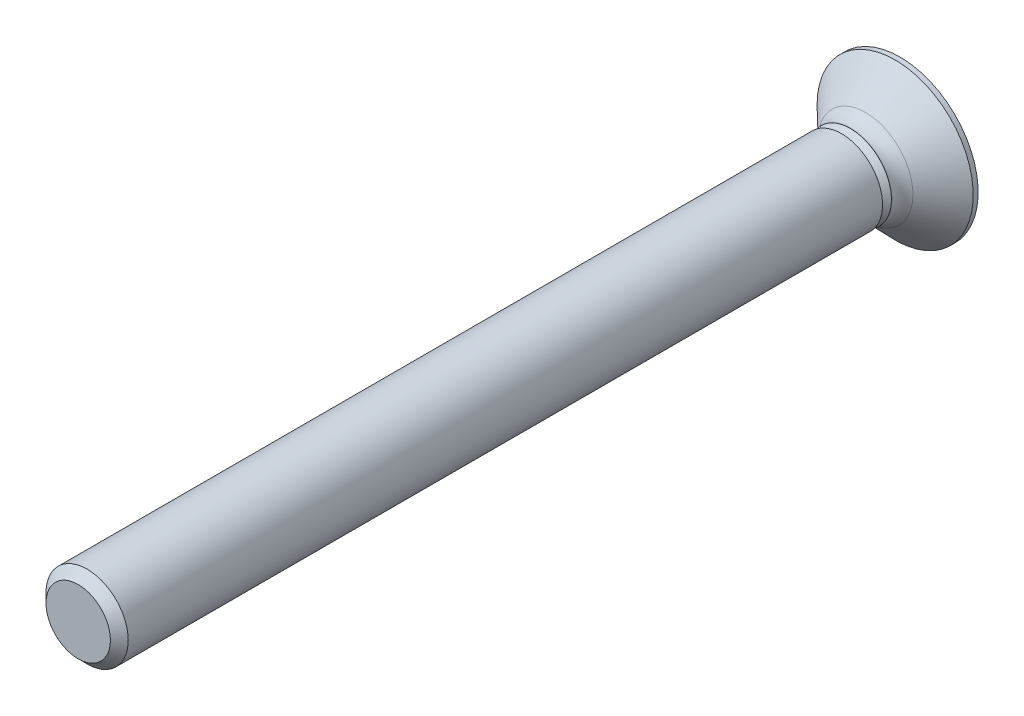
ISO-10303-21;
HEADER;
FILE_DESCRIPTION(('STEP AP214'),'2;1');
FILE_NAME('part.step','',(''),(''),'','','');
FILE_SCHEMA(('AUTOMOTIVE_DESIGN { 1 0 10303 214 1 1 1 1 }'));
ENDSEC;
DATA;
#1=APPLICATION_CONTEXT('core data for automotive mechanical design processes');
#2=APPLICATION_PROTOCOL_DEFINITION('international standard','automotive_design',2000,#1);
#3=PRODUCT_CONTEXT('',#1,'mechanical');
#4=PRODUCT('Part','Part','',(#3));
#5=PRODUCT_RELATED_PRODUCT_CATEGORY('part','',(#4));
#6=PRODUCT_DEFINITION_FORMATION('','',#4);
#7=PRODUCT_DEFINITION_CONTEXT('part definition',#1,'design');
#8=PRODUCT_DEFINITION('design','',#6,#7);
#9=PRODUCT_DEFINITION_SHAPE('','',#8);
#10=(LENGTH_UNIT() NAMED_UNIT(*) SI_UNIT(.MILLI.,.METRE.));
#11=(NAMED_UNIT(*) PLANE_ANGLE_UNIT() SI_UNIT($,.RADIAN.));
#12=(NAMED_UNIT(*) SI_UNIT($,.STERADIAN.) SOLID_ANGLE_UNIT());
#13=UNCERTAINTY_MEASURE_WITH_UNIT(LENGTH_MEASURE(1.E-05),#10,'distance_accuracy_value','');
#14=(GEOMETRIC_REPRESENTATION_CONTEXT(3) GLOBAL_UNCERTAINTY_ASSIGNED_CONTEXT((#13)) GLOBAL_UNIT_ASSIGNED_CONTEXT((#10,
#11,#12)) REPRESENTATION_CONTEXT('',''));
#15=CARTESIAN_POINT('',(0.,0.,0.));
#16=DIRECTION('',(0.,0.,1.));
#17=DIRECTION('',(1.,0.,0.));
#18=AXIS2_PLACEMENT_3D('',#15,#16,#17);
#19=CARTESIAN_POINT('',(0.,0.,42.2262328618571));
#20=DIRECTION('',(0.,0.,-1.));
#21=DIRECTION('',(-1.,0.,0.));
#22=AXIS2_PLACEMENT_3D('',#19,#20,#21);
#23=CYLINDRICAL_SURFACE('',#22,3.125);
#24=CARTESIAN_POINT('',(0.,0.,41.5496703618571));
#25=DIRECTION('',(0.,0.,1.));
#26=DIRECTION('',(1.,0.,0.));
#27=AXIS2_PLACEMENT_3D('',#24,#25,#26);
#28=CIRCLE('',#27,3.125);
#29=CARTESIAN_POINT('',(3.125,0.,41.5496703618571));
#30=VERTEX_POINT('',#29);
#31=EDGE_CURVE('E243',#30,#30,#28,.F.);
#32=ORIENTED_EDGE('',*,*,#31,.T.);
#33=EDGE_LOOP('',(#32));
#34=FACE_BOUND('',#33,.T.);
#35=CARTESIAN_POINT('',(0.,0.,-15.8159546381429));
#36=DIRECTION('',(0.,0.,-1.));
#37=DIRECTION('',(-1.,0.,0.));
#38=AXIS2_PLACEMENT_3D('',#35,#36,#37);
#39=CIRCLE('',#38,3.125);
#40=CARTESIAN_POINT('',(-3.125,0.,-15.8159546381429));
#41=VERTEX_POINT('',#40);
#42=EDGE_CURVE('E240',#41,#41,#39,.T.);
#43=ORIENTED_EDGE('',*,*,#42,.F.);
#44=EDGE_LOOP('',(#43));
#45=FACE_BOUND('',#44,.T.);
#46=ADVANCED_FACE('F35',(#34,#45),#23,.T.);
#47=CARTESIAN_POINT('',(3.125,0.,42.2262328618571));
#48=DIRECTION('',(0.,0.,1.));
#49=DIRECTION('',(1.,0.,0.));
#50=AXIS2_PLACEMENT_3D('',#47,#48,#49);
#51=PLANE('',#50);
#52=CARTESIAN_POINT('',(0.,0.,42.2262328618571));
#53=DIRECTION('',(0.,0.,1.));
#54=DIRECTION('',(1.,0.,0.));
#55=AXIS2_PLACEMENT_3D('',#52,#53,#54);
#56=CIRCLE('',#55,2.44843749999999);
#57=CARTESIAN_POINT('',(2.4484375,0.,42.2262328618571));
#58=VERTEX_POINT('',#57);
#59=EDGE_CURVE('E246',#58,#58,#56,.T.);
#60=ORIENTED_EDGE('',*,*,#59,.T.);
#61=EDGE_LOOP('',(#60));
#62=FACE_BOUND('',#61,.T.);
#63=ADVANCED_FACE('F264',(#62),#51,.T.);
#64=CARTESIAN_POINT('',(0.,0.,-15.8159546381429));
#65=DIRECTION('',(0.,0.,-1.));
#66=DIRECTION('',(-1.,0.,0.));
#67=AXIS2_PLACEMENT_3D('',#64,#65,#66);
#68=PLANE('',#67);
#69=CARTESIAN_POINT('',(0.,0.,-15.8159546381429));
#70=DIRECTION('',(0.,0.,-1.));
#71=DIRECTION('',(-1.,0.,0.));
#72=AXIS2_PLACEMENT_3D('',#69,#70,#71);
#73=CIRCLE('',#72,2.4484375);
#74=CARTESIAN_POINT('',(-2.4484375,0.,-15.8159546381429));
#75=VERTEX_POINT('',#74);
#76=EDGE_CURVE('E234',#75,#75,#73,.T.);
#77=ORIENTED_EDGE('',*,*,#76,.F.);
#78=EDGE_LOOP('',(#77));
#79=FACE_BOUND('',#78,.T.);
#80=ORIENTED_EDGE('',*,*,#42,.T.);
#81=EDGE_LOOP('',(#80));
#82=FACE_BOUND('',#81,.T.);
#83=ADVANCED_FACE('F270',(#79,#82),#68,.T.);
#84=CARTESIAN_POINT('',(0.,0.,-15.8159546381429));
#85=DIRECTION('',(0.,0.,-1.));
#86=DIRECTION('',(-1.,0.,0.));
#87=AXIS2_PLACEMENT_3D('',#84,#85,#86);
#88=CONICAL_SURFACE('',#87,2.4484375,0.785398163397452);
#89=CARTESIAN_POINT('',(0.,0.,-16.4925171381429));
#90=DIRECTION('',(0.,0.,-1.));
#91=DIRECTION('',(-1.,0.,0.));
#92=AXIS2_PLACEMENT_3D('',#89,#90,#91);
#93=CIRCLE('',#92,3.12500000000001);
#94=CARTESIAN_POINT('',(-3.12500000000001,0.,-16.4925171381429));
#95=VERTEX_POINT('',#94);
#96=EDGE_CURVE('E237',#95,#95,#93,.T.);
#97=ORIENTED_EDGE('',*,*,#96,.F.);
#98=EDGE_LOOP('',(#97));
#99=FACE_BOUND('',#98,.T.);
#100=ORIENTED_EDGE('',*,*,#76,.T.);
#101=EDGE_LOOP('',(#100));
#102=FACE_BOUND('',#101,.T.);
#103=ADVANCED_FACE('F277',(#99,#102),#88,.T.);
#104=CARTESIAN_POINT('',(0.,0.,-17.1874382337001));
#105=DIRECTION('',(0.,0.,1.));
#106=DIRECTION('',(1.,0.,0.));
#107=AXIS2_PLACEMENT_3D('',#104,#105,#106);
#108=CYLINDRICAL_SURFACE('',#107,3.125);
#109=CARTESIAN_POINT('',(0.,0.,-16.5234032073764));
#110=DIRECTION('',(0.,0.,-1.));
#111=DIRECTION('',(-1.,0.,0.));
#112=AXIS2_PLACEMENT_3D('',#109,#110,#111);
#113=CIRCLE('',#112,3.125);
#114=CARTESIAN_POINT('',(-3.125,0.,-16.5234032073764));
#115=VERTEX_POINT('',#114);
#116=EDGE_CURVE('E11',#115,#115,#113,.F.);
#117=ORIENTED_EDGE('',*,*,#116,.T.);
#118=EDGE_LOOP('',(#117));
#119=FACE_BOUND('',#118,.T.);
#120=ORIENTED_EDGE('',*,*,#96,.T.);
#121=EDGE_LOOP('',(#120));
#122=FACE_BOUND('',#121,.T.);
#123=ADVANCED_FACE('F281',(#119,#122),#108,.T.);
#124=CARTESIAN_POINT('',(0.,0.,-17.1874382337001));
#125=DIRECTION('',(0.,0.,-1.));
#126=DIRECTION('',(-1.,0.,0.));
#127=AXIS2_PLACEMENT_3D('',#124,#125,#126);
#128=CONICAL_SURFACE('',#127,3.125,0.803711508514973);
#129=CARTESIAN_POINT('',(0.,0.,-17.648304733871));
#130=DIRECTION('',(0.,0.,-1.));
#131=DIRECTION('',(-1.,0.,0.));
#132=AXIS2_PLACEMENT_3D('',#129,#130,#131);
#133=CIRCLE('',#132,3.60306336944473);
#134=CARTESIAN_POINT('',(-3.60306336944473,0.,-17.648304733871));
#135=VERTEX_POINT('',#134);
#136=EDGE_CURVE('E43',#135,#135,#133,.T.);
#137=ORIENTED_EDGE('',*,*,#136,.T.);
#138=EDGE_LOOP('',(#137));
#139=FACE_BOUND('',#138,.T.);
#140=CARTESIAN_POINT('',(0.,0.,-19.8987671381429));
#141=DIRECTION('',(0.,0.,-1.));
#142=DIRECTION('',(-1.,0.,0.));
#143=AXIS2_PLACEMENT_3D('',#140,#141,#142);
#144=CIRCLE('',#143,5.93750000000002);
#145=CARTESIAN_POINT('',(-5.93750000000002,0.,-19.8987671381429));
#146=VERTEX_POINT('',#145);
#147=EDGE_CURVE('E231',#146,#146,#144,.T.);
#148=ORIENTED_EDGE('',*,*,#147,.F.);
#149=EDGE_LOOP('',(#148));
#150=FACE_BOUND('',#149,.T.);
#151=ADVANCED_FACE('F251',(#139,#150),#128,.T.);
#152=CARTESIAN_POINT('',(0.,0.,-20.2737671381429));
#153=DIRECTION('',(0.,0.,1.));
#154=DIRECTION('',(1.,0.,0.));
#155=AXIS2_PLACEMENT_3D('',#152,#153,#154);
#156=CYLINDRICAL_SURFACE('',#155,5.9375);
#157=CARTESIAN_POINT('',(0.,0.,-20.2737671381429));
#158=DIRECTION('',(0.,0.,-1.));
#159=DIRECTION('',(-1.,0.,0.));
#160=AXIS2_PLACEMENT_3D('',#157,#158,#159);
#161=CIRCLE('',#160,5.9375);
#162=CARTESIAN_POINT('',(-5.9375,0.,-20.2737671381429));
#163=VERTEX_POINT('',#162);
#164=EDGE_CURVE('E179',#163,#163,#161,.T.);
#165=ORIENTED_EDGE('',*,*,#164,.F.);
#166=EDGE_LOOP('',(#165));
#167=FACE_BOUND('',#166,.T.);
#168=ORIENTED_EDGE('',*,*,#147,.T.);
#169=EDGE_LOOP('',(#168));
#170=FACE_BOUND('',#169,.T.);
#171=ADVANCED_FACE('F288',(#167,#170),#156,.T.);
#172=CARTESIAN_POINT('',(0.,0.,-20.2737671381429));
#173=DIRECTION('',(0.,0.,-1.));
#174=DIRECTION('',(-1.,0.,0.));
#175=AXIS2_PLACEMENT_3D('',#172,#173,#174);
#176=PLANE('',#175);
#177=DIRECTION('',(0.,-1.,0.));
#178=VECTOR('',#177,1.);
#179=CARTESIAN_POINT('',(2.96875,0.494791666666667,-20.2737671381429));
#180=LINE('',#179,#178);
#181=CARTESIAN_POINT('',(2.96875,0.494791666666667,-20.2737671381429));
#182=VERTEX_POINT('',#181);
#183=CARTESIAN_POINT('',(2.96875,-0.494791666666667,-20.2737671381429));
#184=VERTEX_POINT('',#183);
#185=EDGE_CURVE('E50',#182,#184,#180,.T.);
#186=ORIENTED_EDGE('',*,*,#185,.F.);
#187=DIRECTION('',(0.90630778703665,-0.422618261740699,0.));
#188=VECTOR('',#187,1.);
#189=CARTESIAN_POINT('',(1.28154723625925,1.28154723625925,-20.2737671381429));
#190=LINE('',#189,#188);
#191=CARTESIAN_POINT('',(1.28154723625925,1.28154723625925,-20.2737671381429));
#192=VERTEX_POINT('',#191);
#193=EDGE_CURVE('E175',#192,#182,#190,.T.);
#194=ORIENTED_EDGE('',*,*,#193,.F.);
#195=DIRECTION('',(0.422618261740699,-0.90630778703665,0.));
#196=VECTOR('',#195,1.);
#197=CARTESIAN_POINT('',(0.494791666666666,2.96875,-20.2737671381429));
#198=LINE('',#197,#196);
#199=CARTESIAN_POINT('',(0.494791666666666,2.96875,-20.2737671381429));
#200=VERTEX_POINT('',#199);
#201=EDGE_CURVE('E173',#200,#192,#198,.T.);
#202=ORIENTED_EDGE('',*,*,#201,.F.);
#203=DIRECTION('',(1.,0.,0.));
#204=VECTOR('',#203,1.);
#205=CARTESIAN_POINT('',(-0.494791666666668,2.96875,-20.2737671381429));
#206=LINE('',#205,#204);
#207=CARTESIAN_POINT('',(-0.494791666666668,2.96875,-20.2737671381429));
#208=VERTEX_POINT('',#207);
#209=EDGE_CURVE('E170',#208,#200,#206,.T.);
#210=ORIENTED_EDGE('',*,*,#209,.F.);
#211=DIRECTION('',(0.422618261740698,0.90630778703665,0.));
#212=VECTOR('',#211,1.);
#213=CARTESIAN_POINT('',(-1.28154723625925,1.28154723625925,-20.2737671381429));
#214=LINE('',#213,#212);
#215=CARTESIAN_POINT('',(-1.28154723625925,1.28154723625925,-20.2737671381429));
#216=VERTEX_POINT('',#215);
#217=EDGE_CURVE('E167',#216,#208,#214,.T.);
#218=ORIENTED_EDGE('',*,*,#217,.F.);
#219=DIRECTION('',(0.90630778703665,0.422618261740699,0.));
#220=VECTOR('',#219,1.);
#221=CARTESIAN_POINT('',(-2.96875,0.494791666666667,-20.2737671381429));
#222=LINE('',#221,#220);
#223=CARTESIAN_POINT('',(-2.96875,0.494791666666667,-20.2737671381429));
#224=VERTEX_POINT('',#223);
#225=EDGE_CURVE('E164',#224,#216,#222,.T.);
#226=ORIENTED_EDGE('',*,*,#225,.F.);
#227=DIRECTION('',(0.,1.,0.));
#228=VECTOR('',#227,1.);
#229=CARTESIAN_POINT('',(-2.96875,-0.494791666666666,-20.2737671381429));
#230=LINE('',#229,#228);
#231=CARTESIAN_POINT('',(-2.96875,-0.494791666666666,-20.2737671381429));
#232=VERTEX_POINT('',#231);
#233=EDGE_CURVE('E161',#232,#224,#230,.T.);
#234=ORIENTED_EDGE('',*,*,#233,.F.);
#235=DIRECTION('',(-0.90630778703665,0.422618261740699,0.));
#236=VECTOR('',#235,1.);
#237=CARTESIAN_POINT('',(-1.28154723625926,-1.28154723625925,-20.2737671381429));
#238=LINE('',#237,#236);
#239=CARTESIAN_POINT('',(-1.28154723625926,-1.28154723625925,-20.2737671381429));
#240=VERTEX_POINT('',#239);
#241=EDGE_CURVE('E158',#240,#232,#238,.T.);
#242=ORIENTED_EDGE('',*,*,#241,.F.);
#243=DIRECTION('',(-0.422618261740699,0.90630778703665,0.));
#244=VECTOR('',#243,1.);
#245=CARTESIAN_POINT('',(-0.494791666666668,-2.96875,-20.2737671381429));
#246=LINE('',#245,#244);
#247=CARTESIAN_POINT('',(-0.494791666666668,-2.96875,-20.2737671381429));
#248=VERTEX_POINT('',#247);
#249=EDGE_CURVE('E152',#248,#240,#246,.T.);
#250=ORIENTED_EDGE('',*,*,#249,.F.);
#251=DIRECTION('',(-1.,0.,0.));
#252=VECTOR('',#251,1.);
#253=CARTESIAN_POINT('',(0.494791666666666,-2.96875,-20.2737671381429));
#254=LINE('',#253,#252);
#255=CARTESIAN_POINT('',(0.494791666666666,-2.96875,-20.2737671381429));
#256=VERTEX_POINT('',#255);
#257=EDGE_CURVE('E150',#256,#248,#254,.T.);
#258=ORIENTED_EDGE('',*,*,#257,.F.);
#259=DIRECTION('',(-0.422618261740699,-0.90630778703665,0.));
#260=VECTOR('',#259,1.);
#261=CARTESIAN_POINT('',(1.28154723625925,-1.28154723625926,-20.2737671381429));
#262=LINE('',#261,#260);
#263=CARTESIAN_POINT('',(1.28154723625925,-1.28154723625926,-20.2737671381429));
#264=VERTEX_POINT('',#263);
#265=EDGE_CURVE('E133',#264,#256,#262,.T.);
#266=ORIENTED_EDGE('',*,*,#265,.F.);
#267=DIRECTION('',(-0.90630778703665,-0.4226182617407,0.));
#268=VECTOR('',#267,1.);
#269=CARTESIAN_POINT('',(2.96875,-0.494791666666667,-20.2737671381429));
#270=LINE('',#269,#268);
#271=EDGE_CURVE('E142',#184,#264,#270,.T.);
#272=ORIENTED_EDGE('',*,*,#271,.F.);
#273=EDGE_LOOP('',(#186,#194,#202,#210,#218,#226,#234,#242,#250,#258,#266,#272));
#274=FACE_BOUND('',#273,.T.);
#275=ORIENTED_EDGE('',*,*,#164,.T.);
#276=EDGE_LOOP('',(#275));
#277=FACE_BOUND('',#276,.T.);
#278=ADVANCED_FACE('F146',(#274,#277),#176,.T.);
#279=CARTESIAN_POINT('',(2.96875,0.494791666666667,-20.2737671381429));
#280=DIRECTION('',(0.965925826289069,0.,0.258819045102518));
#281=DIRECTION('',(0.258819045102518,0.,-0.965925826289069));
#282=AXIS2_PLACEMENT_3D('',#279,#280,#281);
#283=PLANE('',#282);
#284=ORIENTED_EDGE('',*,*,#185,.T.);
#285=DIRECTION('',(0.255370893567971,-0.16268920176799,-0.953057149569946));
#286=VECTOR('',#285,1.);
#287=CARTESIAN_POINT('',(2.92763668490845,-0.468599596298635,-20.1203301573536));
#288=LINE('',#287,#286);
#289=CARTESIAN_POINT('',(2.21514289628748,-0.0146909925581505,-17.4612671381429));
#290=VERTEX_POINT('',#289);
#291=EDGE_CURVE('E93',#290,#184,#288,.T.);
#292=ORIENTED_EDGE('',*,*,#291,.F.);
#293=DIRECTION('',(0.,-1.,0.));
#294=VECTOR('',#293,1.);
#295=CARTESIAN_POINT('',(2.21514289628748,0.,-17.4612671381429));
#296=LINE('',#295,#294);
#297=CARTESIAN_POINT('',(2.21514289628748,0.0146909925581504,-17.4612671381429));
#298=VERTEX_POINT('',#297);
#299=EDGE_CURVE('E177',#298,#290,#296,.T.);
#300=ORIENTED_EDGE('',*,*,#299,.F.);
#301=DIRECTION('',(0.255370893567971,0.16268920176799,-0.953057149569946));
#302=VECTOR('',#301,1.);
#303=CARTESIAN_POINT('',(2.89140687934748,0.4455186646209,-19.9851186822517));
#304=LINE('',#303,#302);
#305=EDGE_CURVE('E58',#298,#182,#304,.T.);
#306=ORIENTED_EDGE('',*,*,#305,.T.);
#307=EDGE_LOOP('',(#284,#292,#300,#306));
#308=FACE_BOUND('',#307,.T.);
#309=ADVANCED_FACE('F294',(#308),#283,.F.);
#310=CARTESIAN_POINT('',(1.28154723625925,1.28154723625925,-20.2737671381429));
#311=DIRECTION('',(0.408217893676735,0.875426098065594,0.258819045102518));
#312=DIRECTION('',(-0.90630778703665,0.422618261740699,0.));
#313=AXIS2_PLACEMENT_3D('',#310,#311,#312);
#314=PLANE('',#313);
#315=ORIENTED_EDGE('',*,*,#193,.T.);
#316=ORIENTED_EDGE('',*,*,#305,.F.);
#317=DIRECTION('',(0.90630778703665,-0.422618261740699,0.));
#318=VECTOR('',#317,1.);
#319=CARTESIAN_POINT('',(0.401265221040901,0.860516043482013,-17.4612671381429));
#320=LINE('',#319,#318);
#321=CARTESIAN_POINT('',(0.714467446976875,0.714467446976876,-17.4612671381429));
#322=VERTEX_POINT('',#321);
#323=EDGE_CURVE('E180',#322,#298,#320,.T.);
#324=ORIENTED_EDGE('',*,*,#323,.F.);
#325=DIRECTION('',(0.193899607686985,0.193899607686985,-0.961668281829897));
#326=VECTOR('',#325,1.);
#327=CARTESIAN_POINT('',(1.28154723625925,1.28154723625925,-20.2737671381429));
#328=LINE('',#327,#326);
#329=EDGE_CURVE('E98',#322,#192,#328,.T.);
#330=ORIENTED_EDGE('',*,*,#329,.T.);
#331=EDGE_LOOP('',(#315,#316,#324,#330));
#332=FACE_BOUND('',#331,.T.);
#333=ADVANCED_FACE('F295',(#332),#314,.F.);
#334=CARTESIAN_POINT('',(0.494791666666666,2.96875,-20.2737671381429));
#335=DIRECTION('',(0.875426098065594,0.408217893676735,0.258819045102518));
#336=DIRECTION('',(-0.422618261740699,0.90630778703665,0.));
#337=AXIS2_PLACEMENT_3D('',#334,#335,#336);
#338=PLANE('',#337);
#339=ORIENTED_EDGE('',*,*,#201,.T.);
#340=ORIENTED_EDGE('',*,*,#329,.F.);
#341=DIRECTION('',(0.422618261740699,-0.90630778703665,0.));
#342=VECTOR('',#341,1.);
#343=CARTESIAN_POINT('',(0.860516043482012,0.401265221040902,-17.4612671381429));
#344=LINE('',#343,#342);
#345=CARTESIAN_POINT('',(0.0146909925581491,2.21514289628748,-17.4612671381429));
#346=VERTEX_POINT('',#345);
#347=EDGE_CURVE('E203',#346,#322,#344,.T.);
#348=ORIENTED_EDGE('',*,*,#347,.F.);
#349=DIRECTION('',(0.16268920176799,0.255370893567971,-0.953057149569946));
#350=VECTOR('',#349,1.);
#351=CARTESIAN_POINT('',(0.468599596298634,2.92763668490845,-20.1203301573536));
#352=LINE('',#351,#350);
#353=EDGE_CURVE('E195',#346,#200,#352,.T.);
#354=ORIENTED_EDGE('',*,*,#353,.T.);
#355=EDGE_LOOP('',(#339,#340,#348,#354));
#356=FACE_BOUND('',#355,.T.);
#357=ADVANCED_FACE('F298',(#356),#338,.F.);
#358=CARTESIAN_POINT('',(-0.494791666666668,2.96875,-20.2737671381429));
#359=DIRECTION('',(0.,0.965925826289069,0.258819045102518));
#360=DIRECTION('',(0.,-0.258819045102518,0.965925826289069));
#361=AXIS2_PLACEMENT_3D('',#358,#359,#360);
#362=PLANE('',#361);
#363=ORIENTED_EDGE('',*,*,#209,.T.);
#364=ORIENTED_EDGE('',*,*,#353,.F.);
#365=DIRECTION('',(1.,0.,0.));
#366=VECTOR('',#365,1.);
#367=CARTESIAN_POINT('',(0.,2.21514289628748,-17.4612671381429));
#368=LINE('',#367,#366);
#369=CARTESIAN_POINT('',(-0.0146909925581508,2.21514289628748,-17.4612671381429));
#370=VERTEX_POINT('',#369);
#371=EDGE_CURVE('E206',#370,#346,#368,.T.);
#372=ORIENTED_EDGE('',*,*,#371,.F.);
#373=DIRECTION('',(-0.16268920176799,0.255370893567971,-0.953057149569946));
#374=VECTOR('',#373,1.);
#375=CARTESIAN_POINT('',(-0.445518664620901,2.89140687934748,-19.9851186822517));
#376=LINE('',#375,#374);
#377=EDGE_CURVE('E193',#370,#208,#376,.T.);
#378=ORIENTED_EDGE('',*,*,#377,.T.);
#379=EDGE_LOOP('',(#363,#364,#372,#378));
#380=FACE_BOUND('',#379,.T.);
#381=ADVANCED_FACE('F301',(#380),#362,.F.);
#382=CARTESIAN_POINT('',(-1.28154723625925,1.28154723625925,-20.2737671381429));
#383=DIRECTION('',(-0.875426098065594,0.408217893676734,0.258819045102518));
#384=DIRECTION('',(-0.422618261740698,-0.90630778703665,0.));
#385=AXIS2_PLACEMENT_3D('',#382,#383,#384);
#386=PLANE('',#385);
#387=ORIENTED_EDGE('',*,*,#217,.T.);
#388=ORIENTED_EDGE('',*,*,#377,.F.);
#389=DIRECTION('',(0.422618261740698,0.90630778703665,0.));
#390=VECTOR('',#389,1.);
#391=CARTESIAN_POINT('',(-0.860516043482012,0.4012652210409,-17.4612671381429));
#392=LINE('',#391,#390);
#393=CARTESIAN_POINT('',(-0.714467446976875,0.714467446976876,-17.4612671381429));
#394=VERTEX_POINT('',#393);
#395=EDGE_CURVE('E209',#394,#370,#392,.T.);
#396=ORIENTED_EDGE('',*,*,#395,.F.);
#397=DIRECTION('',(-0.193899607686985,0.193899607686985,-0.961668281829897));
#398=VECTOR('',#397,1.);
#399=CARTESIAN_POINT('',(-1.28154723625925,1.28154723625925,-20.2737671381429));
#400=LINE('',#399,#398);
#401=EDGE_CURVE('E191',#394,#216,#400,.T.);
#402=ORIENTED_EDGE('',*,*,#401,.T.);
#403=EDGE_LOOP('',(#387,#388,#396,#402));
#404=FACE_BOUND('',#403,.T.);
#405=ADVANCED_FACE('F305',(#404),#386,.F.);
#406=CARTESIAN_POINT('',(-2.96875,0.494791666666667,-20.2737671381429));
#407=DIRECTION('',(-0.408217893676735,0.875426098065594,0.258819045102518));
#408=DIRECTION('',(-0.90630778703665,-0.422618261740699,0.));
#409=AXIS2_PLACEMENT_3D('',#406,#407,#408);
#410=PLANE('',#409);
#411=ORIENTED_EDGE('',*,*,#225,.T.);
#412=ORIENTED_EDGE('',*,*,#401,.F.);
#413=DIRECTION('',(0.90630778703665,0.422618261740699,0.));
#414=VECTOR('',#413,1.);
#415=CARTESIAN_POINT('',(-0.401265221040902,0.860516043482012,-17.4612671381429));
#416=LINE('',#415,#414);
#417=CARTESIAN_POINT('',(-2.21514289628748,0.0146909925581501,-17.4612671381429));
#418=VERTEX_POINT('',#417);
#419=EDGE_CURVE('E212',#418,#394,#416,.T.);
#420=ORIENTED_EDGE('',*,*,#419,.F.);
#421=DIRECTION('',(-0.255370893567972,0.16268920176799,-0.953057149569946));
#422=VECTOR('',#421,1.);
#423=CARTESIAN_POINT('',(-2.92763668490846,0.468599596298635,-20.1203301573536));
#424=LINE('',#423,#422);
#425=EDGE_CURVE('E189',#418,#224,#424,.T.);
#426=ORIENTED_EDGE('',*,*,#425,.T.);
#427=EDGE_LOOP('',(#411,#412,#420,#426));
#428=FACE_BOUND('',#427,.T.);
#429=ADVANCED_FACE('F309',(#428),#410,.F.);
#430=CARTESIAN_POINT('',(-2.96875,-0.494791666666666,-20.2737671381429));
#431=DIRECTION('',(-0.965925826289069,0.,0.258819045102518));
#432=DIRECTION('',(0.258819045102518,0.,0.965925826289069));
#433=AXIS2_PLACEMENT_3D('',#430,#431,#432);
#434=PLANE('',#433);
#435=ORIENTED_EDGE('',*,*,#233,.T.);
#436=ORIENTED_EDGE('',*,*,#425,.F.);
#437=DIRECTION('',(0.,1.,0.));
#438=VECTOR('',#437,1.);
#439=CARTESIAN_POINT('',(-2.21514289628748,0.,-17.4612671381429));
#440=LINE('',#439,#438);
#441=CARTESIAN_POINT('',(-2.21514289628748,-0.014690992558149,-17.4612671381429));
#442=VERTEX_POINT('',#441);
#443=EDGE_CURVE('E215',#442,#418,#440,.T.);
#444=ORIENTED_EDGE('',*,*,#443,.F.);
#445=DIRECTION('',(-0.255370893567971,-0.16268920176799,-0.953057149569946));
#446=VECTOR('',#445,1.);
#447=CARTESIAN_POINT('',(-2.89140687934748,-0.445518664620899,-19.9851186822517));
#448=LINE('',#447,#446);
#449=EDGE_CURVE('E187',#442,#232,#448,.T.);
#450=ORIENTED_EDGE('',*,*,#449,.T.);
#451=EDGE_LOOP('',(#435,#436,#444,#450));
#452=FACE_BOUND('',#451,.T.);
#453=ADVANCED_FACE('F313',(#452),#434,.F.);
#454=CARTESIAN_POINT('',(-1.28154723625926,-1.28154723625925,-20.2737671381429));
#455=DIRECTION('',(-0.408217893676735,-0.875426098065594,0.258819045102518));
#456=DIRECTION('',(0.90630778703665,-0.422618261740699,0.));
#457=AXIS2_PLACEMENT_3D('',#454,#455,#456);
#458=PLANE('',#457);
#459=ORIENTED_EDGE('',*,*,#241,.T.);
#460=ORIENTED_EDGE('',*,*,#449,.F.);
#461=DIRECTION('',(-0.90630778703665,0.422618261740699,0.));
#462=VECTOR('',#461,1.);
#463=CARTESIAN_POINT('',(-0.401265221040903,-0.860516043482012,-17.4612671381429));
#464=LINE('',#463,#462);
#465=CARTESIAN_POINT('',(-0.714467446976879,-0.714467446976875,-17.4612671381429));
#466=VERTEX_POINT('',#465);
#467=EDGE_CURVE('E218',#466,#442,#464,.T.);
#468=ORIENTED_EDGE('',*,*,#467,.F.);
#469=DIRECTION('',(-0.193899607686985,-0.193899607686985,-0.961668281829897));
#470=VECTOR('',#469,1.);
#471=CARTESIAN_POINT('',(-1.28154723625926,-1.28154723625925,-20.2737671381429));
#472=LINE('',#471,#470);
#473=EDGE_CURVE('E185',#466,#240,#472,.T.);
#474=ORIENTED_EDGE('',*,*,#473,.T.);
#475=EDGE_LOOP('',(#459,#460,#468,#474));
#476=FACE_BOUND('',#475,.T.);
#477=ADVANCED_FACE('F317',(#476),#458,.F.);
#478=CARTESIAN_POINT('',(-0.494791666666668,-2.96875,-20.2737671381429));
#479=DIRECTION('',(-0.875426098065594,-0.408217893676735,0.258819045102518));
#480=DIRECTION('',(0.422618261740699,-0.90630778703665,0.));
#481=AXIS2_PLACEMENT_3D('',#478,#479,#480);
#482=PLANE('',#481);
#483=ORIENTED_EDGE('',*,*,#249,.T.);
#484=ORIENTED_EDGE('',*,*,#473,.F.);
#485=DIRECTION('',(-0.422618261740699,0.90630778703665,0.));
#486=VECTOR('',#485,1.);
#487=CARTESIAN_POINT('',(-0.860516043482015,-0.401265221040903,-17.4612671381429));
#488=LINE('',#487,#486);
#489=CARTESIAN_POINT('',(-0.0146909925581518,-2.21514289628748,-17.4612671381429));
#490=VERTEX_POINT('',#489);
#491=EDGE_CURVE('E221',#490,#466,#488,.T.);
#492=ORIENTED_EDGE('',*,*,#491,.F.);
#493=DIRECTION('',(-0.16268920176799,-0.255370893567971,-0.953057149569946));
#494=VECTOR('',#493,1.);
#495=CARTESIAN_POINT('',(-0.468599596298637,-2.92763668490845,-20.1203301573536));
#496=LINE('',#495,#494);
#497=EDGE_CURVE('E183',#490,#248,#496,.T.);
#498=ORIENTED_EDGE('',*,*,#497,.T.);
#499=EDGE_LOOP('',(#483,#484,#492,#498));
#500=FACE_BOUND('',#499,.T.);
#501=ADVANCED_FACE('F321',(#500),#482,.F.);
#502=CARTESIAN_POINT('',(0.494791666666666,-2.96875,-20.2737671381429));
#503=DIRECTION('',(0.,-0.965925826289069,0.258819045102518));
#504=DIRECTION('',(0.,-0.258819045102518,-0.965925826289069));
#505=AXIS2_PLACEMENT_3D('',#502,#503,#504);
#506=PLANE('',#505);
#507=ORIENTED_EDGE('',*,*,#257,.T.);
#508=ORIENTED_EDGE('',*,*,#497,.F.);
#509=DIRECTION('',(-1.,0.,0.));
#510=VECTOR('',#509,1.);
#511=CARTESIAN_POINT('',(0.,-2.21514289628748,-17.4612671381429));
#512=LINE('',#511,#510);
#513=CARTESIAN_POINT('',(0.0146909925581494,-2.21514289628748,-17.4612671381429));
#514=VERTEX_POINT('',#513);
#515=EDGE_CURVE('E224',#514,#490,#512,.T.);
#516=ORIENTED_EDGE('',*,*,#515,.F.);
#517=DIRECTION('',(0.16268920176799,-0.255370893567971,-0.953057149569946));
#518=VECTOR('',#517,1.);
#519=CARTESIAN_POINT('',(0.445518664620899,-2.89140687934748,-19.9851186822517));
#520=LINE('',#519,#518);
#521=EDGE_CURVE('E139',#514,#256,#520,.T.);
#522=ORIENTED_EDGE('',*,*,#521,.T.);
#523=EDGE_LOOP('',(#507,#508,#516,#522));
#524=FACE_BOUND('',#523,.T.);
#525=ADVANCED_FACE('F325',(#524),#506,.F.);
#526=CARTESIAN_POINT('',(1.28154723625925,-1.28154723625926,-20.2737671381429));
#527=DIRECTION('',(0.875426098065594,-0.408217893676735,0.258819045102518));
#528=DIRECTION('',(0.422618261740699,0.90630778703665,0.));
#529=AXIS2_PLACEMENT_3D('',#526,#527,#528);
#530=PLANE('',#529);
#531=ORIENTED_EDGE('',*,*,#265,.T.);
#532=ORIENTED_EDGE('',*,*,#521,.F.);
#533=DIRECTION('',(-0.422618261740699,-0.90630778703665,0.));
#534=VECTOR('',#533,1.);
#535=CARTESIAN_POINT('',(0.860516043482012,-0.401265221040903,-17.4612671381429));
#536=LINE('',#535,#534);
#537=CARTESIAN_POINT('',(0.714467446976875,-0.714467446976878,-17.4612671381429));
#538=VERTEX_POINT('',#537);
#539=EDGE_CURVE('E136',#538,#514,#536,.T.);
#540=ORIENTED_EDGE('',*,*,#539,.F.);
#541=DIRECTION('',(0.193899607686985,-0.193899607686985,-0.961668281829897));
#542=VECTOR('',#541,1.);
#543=CARTESIAN_POINT('',(1.28154723625925,-1.28154723625926,-20.2737671381429));
#544=LINE('',#543,#542);
#545=EDGE_CURVE('E129',#538,#264,#544,.T.);
#546=ORIENTED_EDGE('',*,*,#545,.T.);
#547=EDGE_LOOP('',(#531,#532,#540,#546));
#548=FACE_BOUND('',#547,.T.);
#549=ADVANCED_FACE('F131',(#548),#530,.F.);
#550=CARTESIAN_POINT('',(2.96875,-0.494791666666667,-20.2737671381429));
#551=DIRECTION('',(0.408217893676735,-0.875426098065594,0.258819045102518));
#552=DIRECTION('',(0.90630778703665,0.4226182617407,0.));
#553=AXIS2_PLACEMENT_3D('',#550,#551,#552);
#554=PLANE('',#553);
#555=ORIENTED_EDGE('',*,*,#271,.T.);
#556=ORIENTED_EDGE('',*,*,#545,.F.);
#557=DIRECTION('',(-0.90630778703665,-0.4226182617407,0.));
#558=VECTOR('',#557,1.);
#559=CARTESIAN_POINT('',(0.401265221040902,-0.860516043482014,-17.4612671381429));
#560=LINE('',#559,#558);
#561=EDGE_CURVE('E200',#290,#538,#560,.T.);
#562=ORIENTED_EDGE('',*,*,#561,.F.);
#563=ORIENTED_EDGE('',*,*,#291,.T.);
#564=EDGE_LOOP('',(#555,#556,#562,#563));
#565=FACE_BOUND('',#564,.T.);
#566=ADVANCED_FACE('F143',(#565),#554,.F.);
#567=CARTESIAN_POINT('',(0.,0.,-17.4612671381429));
#568=DIRECTION('',(0.,0.,-1.));
#569=DIRECTION('',(-1.,0.,0.));
#570=AXIS2_PLACEMENT_3D('',#567,#568,#569);
#571=PLANE('',#570);
#572=ORIENTED_EDGE('',*,*,#299,.T.);
#573=ORIENTED_EDGE('',*,*,#561,.T.);
#574=ORIENTED_EDGE('',*,*,#539,.T.);
#575=ORIENTED_EDGE('',*,*,#515,.T.);
#576=ORIENTED_EDGE('',*,*,#491,.T.);
#577=ORIENTED_EDGE('',*,*,#467,.T.);
#578=ORIENTED_EDGE('',*,*,#443,.T.);
#579=ORIENTED_EDGE('',*,*,#419,.T.);
#580=ORIENTED_EDGE('',*,*,#395,.T.);
#581=ORIENTED_EDGE('',*,*,#371,.T.);
#582=ORIENTED_EDGE('',*,*,#347,.T.);
#583=ORIENTED_EDGE('',*,*,#323,.T.);
#584=EDGE_LOOP('',(#572,#573,#574,#575,#576,#577,#578,#579,#580,#581,#582,#583));
#585=FACE_BOUND('',#584,.T.);
#586=ADVANCED_FACE('F260',(#585),#571,.T.);
#587=CARTESIAN_POINT('',(0.,0.,41.5496703618571));
#588=DIRECTION('',(0.,0.,-1.));
#589=DIRECTION('',(-1.,0.,0.));
#590=AXIS2_PLACEMENT_3D('',#587,#588,#589);
#591=CONICAL_SURFACE('',#590,3.125,0.785398163397449);
#592=ORIENTED_EDGE('',*,*,#59,.F.);
#593=EDGE_LOOP('',(#592));
#594=FACE_BOUND('',#593,.T.);
#595=ORIENTED_EDGE('',*,*,#31,.F.);
#596=EDGE_LOOP('',(#595));
#597=FACE_BOUND('',#596,.T.);
#598=ADVANCED_FACE('F255',(#594,#597),#591,.T.);
#599=CARTESIAN_POINT('',(0.,0.,-16.5234032073764));
#600=DIRECTION('',(0.,0.,-1.));
#601=DIRECTION('',(-1.,0.,0.));
#602=AXIS2_PLACEMENT_3D('',#599,#600,#601);
#603=TOROIDAL_SURFACE('',#602,4.6875,1.5625);
#604=ORIENTED_EDGE('',*,*,#116,.F.);
#605=EDGE_LOOP('',(#604));
#606=FACE_BOUND('',#605,.T.);
#607=ORIENTED_EDGE('',*,*,#136,.F.);
#608=EDGE_LOOP('',(#607));
#609=FACE_BOUND('',#608,.T.);
#610=ADVANCED_FACE('F37',(#606,#609),#603,.F.);
#611=CLOSED_SHELL('',(#46,#63,#83,#103,#123,#151,#171,#278,#309,#333,#357,#381,#405,#429,#453,
#477,#501,#525,#549,#566,#586,#598,#610));
#612=MANIFOLD_SOLID_BREP('B2',#611);
#613=ADVANCED_BREP_SHAPE_REPRESENTATION('',(#18,#612),#14);
#614=SHAPE_DEFINITION_REPRESENTATION(#9,#613);
ENDSEC;
END-ISO-10303-21;
